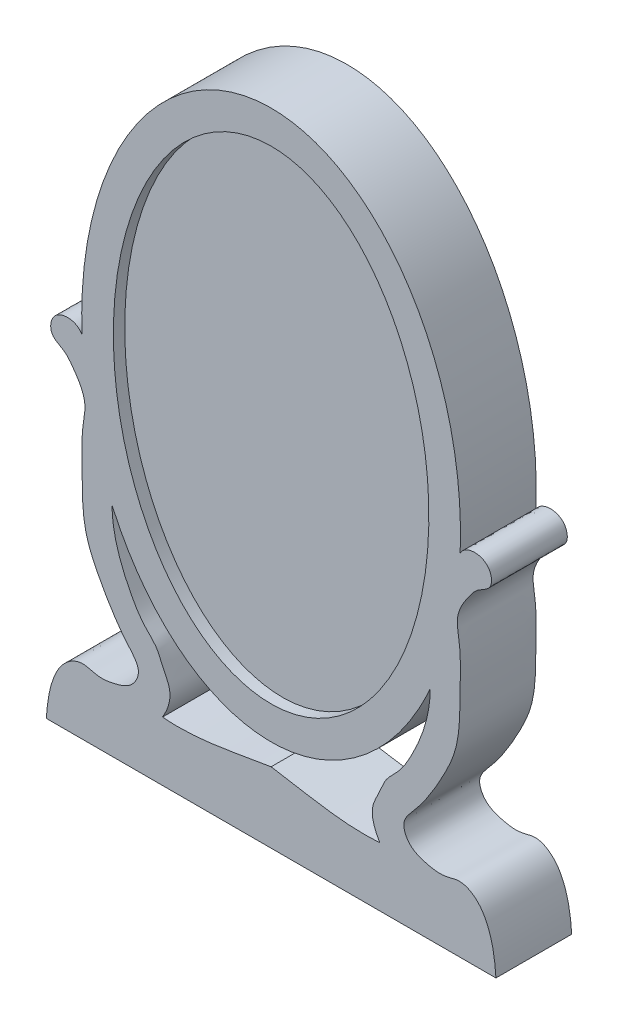
ISO-10303-21;
HEADER;
FILE_DESCRIPTION(('STEP AP214'),'2;1');
FILE_NAME('part.step','',(''),(''),'','','');
FILE_SCHEMA(('AUTOMOTIVE_DESIGN { 1 0 10303 214 1 1 1 1 }'));
ENDSEC;
DATA;
#1=APPLICATION_CONTEXT('core data for automotive mechanical design processes');
#2=APPLICATION_PROTOCOL_DEFINITION('international standard','automotive_design',2000,#1);
#3=PRODUCT_CONTEXT('',#1,'mechanical');
#4=PRODUCT('Part','Part','',(#3));
#5=PRODUCT_RELATED_PRODUCT_CATEGORY('part','',(#4));
#6=PRODUCT_DEFINITION_FORMATION('','',#4);
#7=PRODUCT_DEFINITION_CONTEXT('part definition',#1,'design');
#8=PRODUCT_DEFINITION('design','',#6,#7);
#9=PRODUCT_DEFINITION_SHAPE('','',#8);
#10=(LENGTH_UNIT() NAMED_UNIT(*) SI_UNIT(.MILLI.,.METRE.));
#11=(NAMED_UNIT(*) PLANE_ANGLE_UNIT() SI_UNIT($,.RADIAN.));
#12=(NAMED_UNIT(*) SI_UNIT($,.STERADIAN.) SOLID_ANGLE_UNIT());
#13=UNCERTAINTY_MEASURE_WITH_UNIT(LENGTH_MEASURE(1.E-05),#10,'distance_accuracy_value','');
#14=(GEOMETRIC_REPRESENTATION_CONTEXT(3) GLOBAL_UNCERTAINTY_ASSIGNED_CONTEXT((#13)) GLOBAL_UNIT_ASSIGNED_CONTEXT((#10,
#11,#12)) REPRESENTATION_CONTEXT('',''));
#15=CARTESIAN_POINT('',(0.,0.,0.));
#16=DIRECTION('',(0.,0.,1.));
#17=DIRECTION('',(1.,0.,0.));
#18=AXIS2_PLACEMENT_3D('',#15,#16,#17);
#19=CARTESIAN_POINT('',(0.,0.,5.08));
#20=DIRECTION('',(0.,0.,1.));
#21=DIRECTION('',(0.,1.,0.));
#22=AXIS2_PLACEMENT_3D('',#19,#20,#21);
#23=ELLIPSE('',#22,18.4067671188592,12.7);
#24=DIRECTION('',(0.,0.,-1.));
#25=VECTOR('',#24,1.);
#26=SURFACE_OF_LINEAR_EXTRUSION('',#23,#25);
#27=CARTESIAN_POINT('',(0.,0.,0.));
#28=DIRECTION('',(0.,0.,1.));
#29=DIRECTION('',(0.,1.,0.));
#30=AXIS2_PLACEMENT_3D('',#27,#28,#29);
#31=ELLIPSE('',#30,18.4067671188592,12.7);
#32=CARTESIAN_POINT('',(-10.6691475500699,-9.98468613821812,0.));
#33=VERTEX_POINT('',#32);
#34=CARTESIAN_POINT('',(10.6691475500699,-9.98468613821813,0.));
#35=VERTEX_POINT('',#34);
#36=EDGE_CURVE('E296',#33,#35,#31,.T.);
#37=ORIENTED_EDGE('',*,*,#36,.T.);
#38=DIRECTION('',(0.,0.,-1.));
#39=VECTOR('',#38,1.);
#40=CARTESIAN_POINT('',(10.6691475500699,-9.98468613821812,5.08));
#41=LINE('',#40,#39);
#42=CARTESIAN_POINT('',(10.6691475500699,-9.98468613821813,5.08));
#43=VERTEX_POINT('',#42);
#44=EDGE_CURVE('E193',#43,#35,#41,.T.);
#45=ORIENTED_EDGE('',*,*,#44,.F.);
#46=CARTESIAN_POINT('',(-10.6691475500699,-9.98468613821812,5.08));
#47=VERTEX_POINT('',#46);
#48=EDGE_CURVE('E12',#47,#43,#23,.T.);
#49=ORIENTED_EDGE('',*,*,#48,.F.);
#50=DIRECTION('',(0.,0.,-1.));
#51=VECTOR('',#50,1.);
#52=CARTESIAN_POINT('',(-10.6691475500699,-9.98468613821812,5.08));
#53=LINE('',#52,#51);
#54=EDGE_CURVE('E356',#47,#33,#53,.T.);
#55=ORIENTED_EDGE('',*,*,#54,.T.);
#56=EDGE_LOOP('',(#37,#45,#49,#55));
#57=FACE_BOUND('',#56,.T.);
#58=ADVANCED_FACE('F171',(#57),#26,.F.);
#59=DIRECTION('',(0.,0.,-1.));
#60=VECTOR('',#59,1.);
#61=CARTESIAN_POINT('',(-12.6771092664217,-1.10465007632971,5.08));
#62=LINE('',#61,#60);
#63=CARTESIAN_POINT('',(-12.6771092664217,-1.10465007632971,5.08));
#64=VERTEX_POINT('',#63);
#65=CARTESIAN_POINT('',(-12.6771092664217,-1.10465007632971,0.));
#66=VERTEX_POINT('',#65);
#67=EDGE_CURVE('E352',#64,#66,#62,.T.);
#68=ORIENTED_EDGE('',*,*,#67,.F.);
#69=CARTESIAN_POINT('',(12.6771092664217,-1.10465007632972,5.08));
#70=VERTEX_POINT('',#69);
#71=EDGE_CURVE('E179',#70,#64,#23,.T.);
#72=ORIENTED_EDGE('',*,*,#71,.F.);
#73=DIRECTION('',(0.,0.,-1.));
#74=VECTOR('',#73,1.);
#75=CARTESIAN_POINT('',(12.6771092664217,-1.10465007632972,5.08));
#76=LINE('',#75,#74);
#77=CARTESIAN_POINT('',(12.6771092664217,-1.10465007632972,0.));
#78=VERTEX_POINT('',#77);
#79=EDGE_CURVE('E366',#70,#78,#76,.T.);
#80=ORIENTED_EDGE('',*,*,#79,.T.);
#81=EDGE_CURVE('E175',#78,#66,#31,.T.);
#82=ORIENTED_EDGE('',*,*,#81,.T.);
#83=EDGE_LOOP('',(#68,#72,#80,#82));
#84=FACE_BOUND('',#83,.T.);
#85=ADVANCED_FACE('F340',(#84),#26,.F.);
#86=CARTESIAN_POINT('',(0.,0.,5.08));
#87=DIRECTION('',(0.,0.,1.));
#88=DIRECTION('',(1.,0.,0.));
#89=AXIS2_PLACEMENT_3D('',#86,#87,#88);
#90=PLANE('',#89);
#91=CARTESIAN_POINT('',(0.,0.,5.08));
#92=DIRECTION('',(0.,0.,1.));
#93=DIRECTION('',(0.,1.,0.));
#94=AXIS2_PLACEMENT_3D('',#91,#92,#93);
#95=ELLIPSE('',#94,16.1955645753599,10.5779148702535);
#96=CARTESIAN_POINT('',(0.,16.1955645753599,5.08));
#97=VERTEX_POINT('',#96);
#98=EDGE_CURVE('E252',#97,#97,#95,.T.);
#99=ORIENTED_EDGE('',*,*,#98,.F.);
#100=EDGE_LOOP('',(#99));
#101=FACE_BOUND('',#100,.T.);
#102=CARTESIAN_POINT('',(-7.2823839529546,-20.6026566676611,5.08));
#103=CARTESIAN_POINT('',(-6.98342277815002,-20.1098257484877,5.08));
#104=CARTESIAN_POINT('',(-6.51747466004504,-18.9769482890545,5.08));
#105=CARTESIAN_POINT('',(-7.2607339084114,-17.7808276993082,5.08));
#106=CARTESIAN_POINT('',(-7.64007112429308,-16.6788221014999,5.08));
#107=CARTESIAN_POINT('',(-8.66251628533116,-15.8172191870184,5.08));
#108=CARTESIAN_POINT('',(-9.95338431160144,-13.6011584855846,5.08));
#109=CARTESIAN_POINT('',(-10.6595747076104,-11.575789329115,5.08));
#110=CARTESIAN_POINT('',(-10.6691475500699,-9.98468613821812,5.08));
#111=B_SPLINE_CURVE_WITH_KNOTS('',3,(#102,#103,#104,#105,#106,#107,#108,#109,#110),
.UNSPECIFIED.,.F.,.F.,(4,1,1,1,1,1,4),(0.,0.15686942296698,0.269880163246726,0.345336762558088,
0.453457094986606,0.602334663585348,1.),.UNSPECIFIED.);
#112=CARTESIAN_POINT('',(-7.2823839529546,-20.6026566676611,5.08));
#113=VERTEX_POINT('',#112);
#114=EDGE_CURVE('E412',#113,#47,#111,.T.);
#115=ORIENTED_EDGE('',*,*,#114,.T.);
#116=ORIENTED_EDGE('',*,*,#48,.T.);
#117=CARTESIAN_POINT('',(7.2823839529546,-20.6026566676611,5.08));
#118=CARTESIAN_POINT('',(6.98342277815002,-20.1098257484877,5.08));
#119=CARTESIAN_POINT('',(6.51747466004504,-18.9769482890545,5.08));
#120=CARTESIAN_POINT('',(7.2607339084114,-17.7808276993082,5.08));
#121=CARTESIAN_POINT('',(7.64007112429308,-16.6788221014999,5.08));
#122=CARTESIAN_POINT('',(8.66251628533116,-15.8172191870184,5.08));
#123=CARTESIAN_POINT('',(9.95338431160143,-13.6011584855846,5.08));
#124=CARTESIAN_POINT('',(10.6595747076104,-11.575789329115,5.08));
#125=CARTESIAN_POINT('',(10.6691475500699,-9.98468613821812,5.08));
#126=B_SPLINE_CURVE_WITH_KNOTS('',3,(#117,#118,#119,#120,#121,#122,#123,#124,#125),
.UNSPECIFIED.,.F.,.F.,(4,1,1,1,1,1,4),(0.,0.15686942296698,0.269880163246726,0.345336762558088,
0.453457094986606,0.602334663585348,1.),.UNSPECIFIED.);
#127=CARTESIAN_POINT('',(7.2823839529546,-20.6026566676611,5.08));
#128=VERTEX_POINT('',#127);
#129=EDGE_CURVE('E281',#128,#43,#126,.T.);
#130=ORIENTED_EDGE('',*,*,#129,.F.);
#131=CARTESIAN_POINT('',(0.,-19.8465102284853,5.08));
#132=CARTESIAN_POINT('',(2.41324087105492,-20.2161041744648,5.08));
#133=CARTESIAN_POINT('',(4.82248646221909,-20.8171955088117,5.08));
#134=CARTESIAN_POINT('',(7.2823839529546,-20.6026566676611,5.08));
#135=B_SPLINE_CURVE_WITH_KNOTS('',3,(#131,#132,#133,#134),.UNSPECIFIED.,.F.,.F.,(4,4),(0.,1.),.UNSPECIFIED.);
#136=CARTESIAN_POINT('',(0.,-19.8465102284853,5.08));
#137=VERTEX_POINT('',#136);
#138=EDGE_CURVE('E287',#137,#128,#135,.T.);
#139=ORIENTED_EDGE('',*,*,#138,.F.);
#140=CARTESIAN_POINT('',(0.,-19.8465102284853,5.08));
#141=CARTESIAN_POINT('',(-2.41324087105492,-20.2161041744648,5.08));
#142=CARTESIAN_POINT('',(-4.82248646221909,-20.8171955088117,5.08));
#143=CARTESIAN_POINT('',(-7.2823839529546,-20.6026566676611,5.08));
#144=B_SPLINE_CURVE_WITH_KNOTS('',3,(#140,#141,#142,#143),.UNSPECIFIED.,.F.,.F.,(4,4),(0.,1.),.UNSPECIFIED.);
#145=EDGE_CURVE('E416',#137,#113,#144,.T.);
#146=ORIENTED_EDGE('',*,*,#145,.T.);
#147=EDGE_LOOP('',(#115,#116,#130,#139,#146));
#148=FACE_BOUND('',#147,.T.);
#149=ORIENTED_EDGE('',*,*,#71,.T.);
#150=CARTESIAN_POINT('',(-12.6771092664217,-1.10465007632971,5.08));
#151=CARTESIAN_POINT('',(-13.0147295738112,-0.444657082307387,5.08));
#152=CARTESIAN_POINT('',(-14.6864182706003,-0.376477606834039,5.08));
#153=CARTESIAN_POINT('',(-14.9010811595817,-2.20349874357206,5.08));
#154=CARTESIAN_POINT('',(-13.8468727845681,-2.55359481217944,5.08));
#155=CARTESIAN_POINT('',(-13.1066873430173,-3.52847703439868,5.08));
#156=CARTESIAN_POINT('',(-12.3217738470595,-4.72228430635433,5.08));
#157=CARTESIAN_POINT('',(-12.5932678124089,-6.06126416897607,5.08));
#158=CARTESIAN_POINT('',(-12.7229799806182,-7.35483466237691,5.08));
#159=CARTESIAN_POINT('',(-12.6355177118635,-9.53580701082996,5.08));
#160=CARTESIAN_POINT('',(-12.7153102267162,-12.1338117629486,5.08));
#161=CARTESIAN_POINT('',(-11.5520621134218,-14.6415573080596,5.08));
#162=CARTESIAN_POINT('',(-10.5923715383723,-16.2888823037932,5.08));
#163=CARTESIAN_POINT('',(-9.60798334182763,-17.599787288778,5.08));
#164=CARTESIAN_POINT('',(-8.6693151901891,-18.5874043002762,5.08));
#165=CARTESIAN_POINT('',(-9.25483692826294,-19.8823878131323,5.08));
#166=CARTESIAN_POINT('',(-10.4033034022069,-20.2836478061833,5.08));
#167=CARTESIAN_POINT('',(-11.5866512887487,-20.4812360129199,5.08));
#168=CARTESIAN_POINT('',(-12.6744540908924,-20.0174941263352,5.08));
#169=CARTESIAN_POINT('',(-13.9505105539649,-20.6483934910517,5.08));
#170=CARTESIAN_POINT('',(-14.8367453791331,-22.2902059831316,5.08));
#171=CARTESIAN_POINT('',(-15.0181806843243,-23.7172792454405,5.08));
#172=CARTESIAN_POINT('',(-15.073740621126,-24.5751461011091,5.08));
#173=B_SPLINE_CURVE_WITH_KNOTS('',3,(#150,#151,#152,#153,#154,#155,#156,#157,#158,#159,#160,
#161,#162,#163,#164,#165,#166,#167,#168,#169,#170,#171,#172),.UNSPECIFIED.,.F.,.F.,(4,1,1,1,1,1,
1,1,1,1,1,1,1,1,1,1,1,1,1,1,4),(0.,0.066937011974706,0.10072406911038,0.132254972668819,
0.158396111068938,0.217811022595416,0.257919350227047,0.28338305854913,0.3418917459887,
0.465467037409962,0.523432420539901,0.60221369183409,0.644587560888476,0.6838925730785,
0.717443218968928,0.758396821979991,0.795190358303998,0.829586575965607,0.863768329870619,
0.918491893212974,1.),.UNSPECIFIED.);
#174=CARTESIAN_POINT('',(-15.073740621126,-24.5751461011091,5.08));
#175=VERTEX_POINT('',#174);
#176=EDGE_CURVE('E417',#64,#175,#173,.T.);
#177=ORIENTED_EDGE('',*,*,#176,.T.);
#178=DIRECTION('',(1.,0.,0.));
#179=VECTOR('',#178,1.);
#180=CARTESIAN_POINT('',(0.,-24.5751461011091,5.08));
#181=LINE('',#180,#179);
#182=CARTESIAN_POINT('',(15.073740621126,-24.5751461011091,5.08));
#183=VERTEX_POINT('',#182);
#184=EDGE_CURVE('E326',#175,#183,#181,.T.);
#185=ORIENTED_EDGE('',*,*,#184,.T.);
#186=CARTESIAN_POINT('',(12.6771092664217,-1.10465007632971,5.08));
#187=CARTESIAN_POINT('',(13.0147295738112,-0.444657082307386,5.08));
#188=CARTESIAN_POINT('',(14.6864182706003,-0.37647760683404,5.08));
#189=CARTESIAN_POINT('',(14.9010811595817,-2.20349874357206,5.08));
#190=CARTESIAN_POINT('',(13.8468727845681,-2.55359481217944,5.08));
#191=CARTESIAN_POINT('',(13.1066873430173,-3.52847703439868,5.08));
#192=CARTESIAN_POINT('',(12.3217738470595,-4.72228430635433,5.08));
#193=CARTESIAN_POINT('',(12.5932678124089,-6.06126416897606,5.08));
#194=CARTESIAN_POINT('',(12.7229799806182,-7.35483466237691,5.08));
#195=CARTESIAN_POINT('',(12.6355177118635,-9.53580701082995,5.08));
#196=CARTESIAN_POINT('',(12.7153102267162,-12.1338117629486,5.08));
#197=CARTESIAN_POINT('',(11.5520621134218,-14.6415573080596,5.08));
#198=CARTESIAN_POINT('',(10.5923715383723,-16.2888823037932,5.08));
#199=CARTESIAN_POINT('',(9.60798334182763,-17.599787288778,5.08));
#200=CARTESIAN_POINT('',(8.6693151901891,-18.5874043002762,5.08));
#201=CARTESIAN_POINT('',(9.25483692826294,-19.8823878131323,5.08));
#202=CARTESIAN_POINT('',(10.4033034022069,-20.2836478061833,5.08));
#203=CARTESIAN_POINT('',(11.5866512887487,-20.4812360129199,5.08));
#204=CARTESIAN_POINT('',(12.6744540908924,-20.0174941263352,5.08));
#205=CARTESIAN_POINT('',(13.9505105539649,-20.6483934910517,5.08));
#206=CARTESIAN_POINT('',(14.8367453791331,-22.2902059831316,5.08));
#207=CARTESIAN_POINT('',(15.0181806843243,-23.7172792454405,5.08));
#208=CARTESIAN_POINT('',(15.073740621126,-24.5751461011091,5.08));
#209=B_SPLINE_CURVE_WITH_KNOTS('',3,(#186,#187,#188,#189,#190,#191,#192,#193,#194,#195,#196,
#197,#198,#199,#200,#201,#202,#203,#204,#205,#206,#207,#208),.UNSPECIFIED.,.F.,.F.,(4,1,1,1,1,1,
1,1,1,1,1,1,1,1,1,1,1,1,1,1,4),(0.,0.066937011974706,0.10072406911038,0.132254972668819,
0.158396111068938,0.217811022595416,0.257919350227047,0.28338305854913,0.3418917459887,
0.465467037409962,0.523432420539901,0.60221369183409,0.644587560888476,0.6838925730785,
0.717443218968928,0.758396821979991,0.795190358303998,0.829586575965607,0.863768329870619,
0.918491893212974,1.),.UNSPECIFIED.);
#210=EDGE_CURVE('E317',#70,#183,#209,.T.);
#211=ORIENTED_EDGE('',*,*,#210,.F.);
#212=EDGE_LOOP('',(#149,#177,#185,#211));
#213=FACE_BOUND('',#212,.T.);
#214=ADVANCED_FACE('F338',(#101,#148,#213),#90,.T.);
#215=CARTESIAN_POINT('',(0.,0.,0.));
#216=DIRECTION('',(0.,0.,1.));
#217=DIRECTION('',(1.,0.,0.));
#218=AXIS2_PLACEMENT_3D('',#215,#216,#217);
#219=PLANE('',#218);
#220=ORIENTED_EDGE('',*,*,#36,.F.);
#221=CARTESIAN_POINT('',(-7.2823839529546,-20.6026566676611,0.));
#222=CARTESIAN_POINT('',(-6.98342277815002,-20.1098257484877,0.));
#223=CARTESIAN_POINT('',(-6.51747466004504,-18.9769482890545,0.));
#224=CARTESIAN_POINT('',(-7.2607339084114,-17.7808276993082,0.));
#225=CARTESIAN_POINT('',(-7.64007112429308,-16.6788221014999,0.));
#226=CARTESIAN_POINT('',(-8.66251628533116,-15.8172191870184,0.));
#227=CARTESIAN_POINT('',(-9.95338431160144,-13.6011584855846,0.));
#228=CARTESIAN_POINT('',(-10.6595747076104,-11.575789329115,0.));
#229=CARTESIAN_POINT('',(-10.6691475500699,-9.98468613821812,0.));
#230=B_SPLINE_CURVE_WITH_KNOTS('',3,(#221,#222,#223,#224,#225,#226,#227,#228,#229),
.UNSPECIFIED.,.F.,.F.,(4,1,1,1,1,1,4),(0.,0.15686942296698,0.269880163246726,0.345336762558088,
0.453457094986606,0.602334663585348,1.),.UNSPECIFIED.);
#231=CARTESIAN_POINT('',(-7.2823839529546,-20.6026566676611,0.));
#232=VERTEX_POINT('',#231);
#233=EDGE_CURVE('E383',#232,#33,#230,.T.);
#234=ORIENTED_EDGE('',*,*,#233,.F.);
#235=CARTESIAN_POINT('',(0.,-19.8465102284853,0.));
#236=CARTESIAN_POINT('',(-2.41324087105492,-20.2161041744648,0.));
#237=CARTESIAN_POINT('',(-4.82248646221909,-20.8171955088117,0.));
#238=CARTESIAN_POINT('',(-7.2823839529546,-20.6026566676611,0.));
#239=B_SPLINE_CURVE_WITH_KNOTS('',3,(#235,#236,#237,#238),.UNSPECIFIED.,.F.,.F.,(4,4),(0.,1.),.UNSPECIFIED.);
#240=CARTESIAN_POINT('',(0.,-19.8465102284853,0.));
#241=VERTEX_POINT('',#240);
#242=EDGE_CURVE('E309',#241,#232,#239,.T.);
#243=ORIENTED_EDGE('',*,*,#242,.F.);
#244=CARTESIAN_POINT('',(0.,-19.8465102284853,0.));
#245=CARTESIAN_POINT('',(2.41324087105492,-20.2161041744648,0.));
#246=CARTESIAN_POINT('',(4.82248646221909,-20.8171955088117,0.));
#247=CARTESIAN_POINT('',(7.2823839529546,-20.6026566676611,0.));
#248=B_SPLINE_CURVE_WITH_KNOTS('',3,(#244,#245,#246,#247),.UNSPECIFIED.,.F.,.F.,(4,4),(0.,1.),.UNSPECIFIED.);
#249=CARTESIAN_POINT('',(7.2823839529546,-20.6026566676611,0.));
#250=VERTEX_POINT('',#249);
#251=EDGE_CURVE('E304',#241,#250,#248,.T.);
#252=ORIENTED_EDGE('',*,*,#251,.T.);
#253=CARTESIAN_POINT('',(7.2823839529546,-20.6026566676611,0.));
#254=CARTESIAN_POINT('',(6.98342277815002,-20.1098257484877,0.));
#255=CARTESIAN_POINT('',(6.51747466004504,-18.9769482890545,0.));
#256=CARTESIAN_POINT('',(7.2607339084114,-17.7808276993082,0.));
#257=CARTESIAN_POINT('',(7.64007112429308,-16.6788221014999,0.));
#258=CARTESIAN_POINT('',(8.66251628533116,-15.8172191870184,0.));
#259=CARTESIAN_POINT('',(9.95338431160143,-13.6011584855846,0.));
#260=CARTESIAN_POINT('',(10.6595747076104,-11.575789329115,0.));
#261=CARTESIAN_POINT('',(10.6691475500699,-9.98468613821812,0.));
#262=B_SPLINE_CURVE_WITH_KNOTS('',3,(#253,#254,#255,#256,#257,#258,#259,#260,#261),
.UNSPECIFIED.,.F.,.F.,(4,1,1,1,1,1,4),(0.,0.15686942296698,0.269880163246726,0.345336762558088,
0.453457094986606,0.602334663585348,1.),.UNSPECIFIED.);
#263=EDGE_CURVE('E301',#250,#35,#262,.T.);
#264=ORIENTED_EDGE('',*,*,#263,.T.);
#265=EDGE_LOOP('',(#220,#234,#243,#252,#264));
#266=FACE_BOUND('',#265,.T.);
#267=CARTESIAN_POINT('',(-12.6771092664217,-1.10465007632971,0.));
#268=CARTESIAN_POINT('',(-13.0147295738112,-0.444657082307387,0.));
#269=CARTESIAN_POINT('',(-14.6864182706003,-0.376477606834039,0.));
#270=CARTESIAN_POINT('',(-14.9010811595817,-2.20349874357206,0.));
#271=CARTESIAN_POINT('',(-13.8468727845681,-2.55359481217944,0.));
#272=CARTESIAN_POINT('',(-13.1066873430173,-3.52847703439868,0.));
#273=CARTESIAN_POINT('',(-12.3217738470595,-4.72228430635433,0.));
#274=CARTESIAN_POINT('',(-12.5932678124089,-6.06126416897607,0.));
#275=CARTESIAN_POINT('',(-12.7229799806182,-7.35483466237691,0.));
#276=CARTESIAN_POINT('',(-12.6355177118635,-9.53580701082996,0.));
#277=CARTESIAN_POINT('',(-12.7153102267162,-12.1338117629486,0.));
#278=CARTESIAN_POINT('',(-11.5520621134218,-14.6415573080596,0.));
#279=CARTESIAN_POINT('',(-10.5923715383723,-16.2888823037932,0.));
#280=CARTESIAN_POINT('',(-9.60798334182763,-17.599787288778,0.));
#281=CARTESIAN_POINT('',(-8.6693151901891,-18.5874043002762,0.));
#282=CARTESIAN_POINT('',(-9.25483692826294,-19.8823878131323,0.));
#283=CARTESIAN_POINT('',(-10.4033034022069,-20.2836478061833,0.));
#284=CARTESIAN_POINT('',(-11.5866512887487,-20.4812360129199,0.));
#285=CARTESIAN_POINT('',(-12.6744540908924,-20.0174941263352,0.));
#286=CARTESIAN_POINT('',(-13.9505105539649,-20.6483934910517,0.));
#287=CARTESIAN_POINT('',(-14.8367453791331,-22.2902059831316,0.));
#288=CARTESIAN_POINT('',(-15.0181806843243,-23.7172792454405,0.));
#289=CARTESIAN_POINT('',(-15.073740621126,-24.5751461011091,0.));
#290=B_SPLINE_CURVE_WITH_KNOTS('',3,(#267,#268,#269,#270,#271,#272,#273,#274,#275,#276,#277,
#278,#279,#280,#281,#282,#283,#284,#285,#286,#287,#288,#289),.UNSPECIFIED.,.F.,.F.,(4,1,1,1,1,1,
1,1,1,1,1,1,1,1,1,1,1,1,1,1,4),(0.,0.066937011974706,0.10072406911038,0.132254972668819,
0.158396111068938,0.217811022595416,0.257919350227047,0.28338305854913,0.3418917459887,
0.465467037409962,0.523432420539901,0.60221369183409,0.644587560888476,0.6838925730785,
0.717443218968928,0.758396821979991,0.795190358303998,0.829586575965607,0.863768329870619,
0.918491893212974,1.),.UNSPECIFIED.);
#291=CARTESIAN_POINT('',(-15.073740621126,-24.5751461011091,0.));
#292=VERTEX_POINT('',#291);
#293=EDGE_CURVE('E379',#66,#292,#290,.T.);
#294=ORIENTED_EDGE('',*,*,#293,.F.);
#295=ORIENTED_EDGE('',*,*,#81,.F.);
#296=CARTESIAN_POINT('',(12.6771092664217,-1.10465007632971,0.));
#297=CARTESIAN_POINT('',(13.0147295738112,-0.444657082307386,0.));
#298=CARTESIAN_POINT('',(14.6864182706003,-0.37647760683404,0.));
#299=CARTESIAN_POINT('',(14.9010811595817,-2.20349874357206,0.));
#300=CARTESIAN_POINT('',(13.8468727845681,-2.55359481217944,0.));
#301=CARTESIAN_POINT('',(13.1066873430173,-3.52847703439868,0.));
#302=CARTESIAN_POINT('',(12.3217738470595,-4.72228430635433,0.));
#303=CARTESIAN_POINT('',(12.5932678124089,-6.06126416897606,0.));
#304=CARTESIAN_POINT('',(12.7229799806182,-7.35483466237691,0.));
#305=CARTESIAN_POINT('',(12.6355177118635,-9.53580701082995,0.));
#306=CARTESIAN_POINT('',(12.7153102267162,-12.1338117629486,0.));
#307=CARTESIAN_POINT('',(11.5520621134218,-14.6415573080596,0.));
#308=CARTESIAN_POINT('',(10.5923715383723,-16.2888823037932,0.));
#309=CARTESIAN_POINT('',(9.60798334182763,-17.599787288778,0.));
#310=CARTESIAN_POINT('',(8.6693151901891,-18.5874043002762,0.));
#311=CARTESIAN_POINT('',(9.25483692826294,-19.8823878131323,0.));
#312=CARTESIAN_POINT('',(10.4033034022069,-20.2836478061833,0.));
#313=CARTESIAN_POINT('',(11.5866512887487,-20.4812360129199,0.));
#314=CARTESIAN_POINT('',(12.6744540908924,-20.0174941263352,0.));
#315=CARTESIAN_POINT('',(13.9505105539649,-20.6483934910517,0.));
#316=CARTESIAN_POINT('',(14.8367453791331,-22.2902059831316,0.));
#317=CARTESIAN_POINT('',(15.0181806843243,-23.7172792454405,0.));
#318=CARTESIAN_POINT('',(15.073740621126,-24.5751461011091,0.));
#319=B_SPLINE_CURVE_WITH_KNOTS('',3,(#296,#297,#298,#299,#300,#301,#302,#303,#304,#305,#306,
#307,#308,#309,#310,#311,#312,#313,#314,#315,#316,#317,#318),.UNSPECIFIED.,.F.,.F.,(4,1,1,1,1,1,
1,1,1,1,1,1,1,1,1,1,1,1,1,1,4),(0.,0.066937011974706,0.10072406911038,0.132254972668819,
0.158396111068938,0.217811022595416,0.257919350227047,0.28338305854913,0.3418917459887,
0.465467037409962,0.523432420539901,0.60221369183409,0.644587560888476,0.6838925730785,
0.717443218968928,0.758396821979991,0.795190358303998,0.829586575965607,0.863768329870619,
0.918491893212974,1.),.UNSPECIFIED.);
#320=CARTESIAN_POINT('',(15.073740621126,-24.5751461011091,0.));
#321=VERTEX_POINT('',#320);
#322=EDGE_CURVE('E286',#78,#321,#319,.T.);
#323=ORIENTED_EDGE('',*,*,#322,.T.);
#324=DIRECTION('',(1.,0.,0.));
#325=VECTOR('',#324,1.);
#326=CARTESIAN_POINT('',(0.,-24.5751461011091,0.));
#327=LINE('',#326,#325);
#328=EDGE_CURVE('E373',#292,#321,#327,.T.);
#329=ORIENTED_EDGE('',*,*,#328,.F.);
#330=EDGE_LOOP('',(#294,#295,#323,#329));
#331=FACE_BOUND('',#330,.T.);
#332=ADVANCED_FACE('F277',(#266,#331),#219,.F.);
#333=DIRECTION('',(0.,0.,-1.));
#334=VECTOR('',#333,1.);
#335=SURFACE_OF_LINEAR_EXTRUSION('',#126,#334);
#336=ORIENTED_EDGE('',*,*,#263,.F.);
#337=DIRECTION('',(0.,0.,-1.));
#338=VECTOR('',#337,1.);
#339=CARTESIAN_POINT('',(7.2823839529546,-20.6026566676611,5.08));
#340=LINE('',#339,#338);
#341=EDGE_CURVE('E263',#128,#250,#340,.T.);
#342=ORIENTED_EDGE('',*,*,#341,.F.);
#343=ORIENTED_EDGE('',*,*,#129,.T.);
#344=ORIENTED_EDGE('',*,*,#44,.T.);
#345=EDGE_LOOP('',(#336,#342,#343,#344));
#346=FACE_BOUND('',#345,.T.);
#347=ADVANCED_FACE('F272',(#346),#335,.T.);
#348=DIRECTION('',(0.,0.,-1.));
#349=VECTOR('',#348,1.);
#350=SURFACE_OF_LINEAR_EXTRUSION('',#135,#349);
#351=ORIENTED_EDGE('',*,*,#251,.F.);
#352=DIRECTION('',(0.,0.,-1.));
#353=VECTOR('',#352,1.);
#354=CARTESIAN_POINT('',(0.,-19.8465102284853,5.08));
#355=LINE('',#354,#353);
#356=EDGE_CURVE('E405',#137,#241,#355,.T.);
#357=ORIENTED_EDGE('',*,*,#356,.F.);
#358=ORIENTED_EDGE('',*,*,#138,.T.);
#359=ORIENTED_EDGE('',*,*,#341,.T.);
#360=EDGE_LOOP('',(#351,#357,#358,#359));
#361=FACE_BOUND('',#360,.T.);
#362=ADVANCED_FACE('F276',(#361),#350,.T.);
#363=DIRECTION('',(0.,0.,-1.));
#364=VECTOR('',#363,1.);
#365=SURFACE_OF_LINEAR_EXTRUSION('',#144,#364);
#366=ORIENTED_EDGE('',*,*,#242,.T.);
#367=DIRECTION('',(0.,0.,-1.));
#368=VECTOR('',#367,1.);
#369=CARTESIAN_POINT('',(-7.2823839529546,-20.6026566676611,5.08));
#370=LINE('',#369,#368);
#371=EDGE_CURVE('E361',#113,#232,#370,.T.);
#372=ORIENTED_EDGE('',*,*,#371,.F.);
#373=ORIENTED_EDGE('',*,*,#145,.F.);
#374=ORIENTED_EDGE('',*,*,#356,.T.);
#375=EDGE_LOOP('',(#366,#372,#373,#374));
#376=FACE_BOUND('',#375,.T.);
#377=ADVANCED_FACE('F402',(#376),#365,.F.);
#378=DIRECTION('',(0.,0.,-1.));
#379=VECTOR('',#378,1.);
#380=SURFACE_OF_LINEAR_EXTRUSION('',#111,#379);
#381=ORIENTED_EDGE('',*,*,#233,.T.);
#382=ORIENTED_EDGE('',*,*,#54,.F.);
#383=ORIENTED_EDGE('',*,*,#114,.F.);
#384=ORIENTED_EDGE('',*,*,#371,.T.);
#385=EDGE_LOOP('',(#381,#382,#383,#384));
#386=FACE_BOUND('',#385,.T.);
#387=ADVANCED_FACE('F409',(#386),#380,.F.);
#388=DIRECTION('',(0.,0.,-1.));
#389=VECTOR('',#388,1.);
#390=SURFACE_OF_LINEAR_EXTRUSION('',#173,#389);
#391=ORIENTED_EDGE('',*,*,#293,.T.);
#392=DIRECTION('',(0.,0.,-1.));
#393=VECTOR('',#392,1.);
#394=CARTESIAN_POINT('',(-15.073740621126,-24.5751461011091,5.08));
#395=LINE('',#394,#393);
#396=EDGE_CURVE('E355',#175,#292,#395,.T.);
#397=ORIENTED_EDGE('',*,*,#396,.F.);
#398=ORIENTED_EDGE('',*,*,#176,.F.);
#399=ORIENTED_EDGE('',*,*,#67,.T.);
#400=EDGE_LOOP('',(#391,#397,#398,#399));
#401=FACE_BOUND('',#400,.T.);
#402=ADVANCED_FACE('F433',(#401),#390,.F.);
#403=CARTESIAN_POINT('',(0.,-24.5751461011091,5.08));
#404=DIRECTION('',(0.,1.,0.));
#405=DIRECTION('',(0.,0.,1.));
#406=AXIS2_PLACEMENT_3D('',#403,#404,#405);
#407=PLANE('',#406);
#408=CARTESIAN_POINT('',(0.,-24.5751461011091,2.54));
#409=DIRECTION('',(0.,-1.,0.));
#410=DIRECTION('',(0.,0.,-1.));
#411=AXIS2_PLACEMENT_3D('',#408,#409,#410);
#412=CIRCLE('',#411,1.72719999999999);
#413=CARTESIAN_POINT('',(0.,-24.5751461011091,0.812800000000011));
#414=VERTEX_POINT('',#413);
#415=EDGE_CURVE('E253',#414,#414,#412,.T.);
#416=ORIENTED_EDGE('',*,*,#415,.F.);
#417=EDGE_LOOP('',(#416));
#418=FACE_BOUND('',#417,.T.);
#419=ORIENTED_EDGE('',*,*,#328,.T.);
#420=DIRECTION('',(0.,0.,-1.));
#421=VECTOR('',#420,1.);
#422=CARTESIAN_POINT('',(15.073740621126,-24.5751461011091,5.08));
#423=LINE('',#422,#421);
#424=EDGE_CURVE('E359',#183,#321,#423,.T.);
#425=ORIENTED_EDGE('',*,*,#424,.F.);
#426=ORIENTED_EDGE('',*,*,#184,.F.);
#427=ORIENTED_EDGE('',*,*,#396,.T.);
#428=EDGE_LOOP('',(#419,#425,#426,#427));
#429=FACE_BOUND('',#428,.T.);
#430=ADVANCED_FACE('F335',(#418,#429),#407,.F.);
#431=DIRECTION('',(0.,0.,-1.));
#432=VECTOR('',#431,1.);
#433=SURFACE_OF_LINEAR_EXTRUSION('',#209,#432);
#434=ORIENTED_EDGE('',*,*,#322,.F.);
#435=ORIENTED_EDGE('',*,*,#79,.F.);
#436=ORIENTED_EDGE('',*,*,#210,.T.);
#437=ORIENTED_EDGE('',*,*,#424,.T.);
#438=EDGE_LOOP('',(#434,#435,#436,#437));
#439=FACE_BOUND('',#438,.T.);
#440=ADVANCED_FACE('F270',(#439),#433,.T.);
#441=CARTESIAN_POINT('',(0.,0.,4.318));
#442=DIRECTION('',(0.,0.,1.));
#443=DIRECTION('',(0.,1.,0.));
#444=AXIS2_PLACEMENT_3D('',#441,#442,#443);
#445=ELLIPSE('',#444,16.1955645753599,10.5779148702535);
#446=DIRECTION('',(0.,0.,1.));
#447=VECTOR('',#446,1.);
#448=SURFACE_OF_LINEAR_EXTRUSION('',#445,#447);
#449=CARTESIAN_POINT('',(0.,16.1955645753599,4.318));
#450=VERTEX_POINT('',#449);
#451=EDGE_CURVE('E256',#450,#450,#445,.T.);
#452=ORIENTED_EDGE('',*,*,#451,.F.);
#453=EDGE_LOOP('',(#452));
#454=FACE_BOUND('',#453,.T.);
#455=ORIENTED_EDGE('',*,*,#98,.T.);
#456=EDGE_LOOP('',(#455));
#457=FACE_BOUND('',#456,.T.);
#458=ADVANCED_FACE('F266',(#454,#457),#448,.F.);
#459=CARTESIAN_POINT('',(0.,0.,4.318));
#460=DIRECTION('',(0.,0.,1.));
#461=DIRECTION('',(1.,0.,0.));
#462=AXIS2_PLACEMENT_3D('',#459,#460,#461);
#463=PLANE('',#462);
#464=ORIENTED_EDGE('',*,*,#451,.T.);
#465=EDGE_LOOP('',(#464));
#466=FACE_BOUND('',#465,.T.);
#467=ADVANCED_FACE('F246',(#466),#463,.T.);
#468=CARTESIAN_POINT('',(0.,-22.0351461011091,2.54));
#469=DIRECTION('',(0.,-1.,0.));
#470=DIRECTION('',(0.,0.,-1.));
#471=AXIS2_PLACEMENT_3D('',#468,#469,#470);
#472=CONICAL_SURFACE('',#471,1.7272,1.02974425867665);
#473=CARTESIAN_POINT('',(0.,-20.9973396399247,2.54));
#474=VERTEX_POINT('',#473);
#475=VERTEX_LOOP('',#474);
#476=FACE_BOUND('',#475,.T.);
#477=CARTESIAN_POINT('',(0.,-22.0351461011091,2.54));
#478=DIRECTION('',(0.,-1.,0.));
#479=DIRECTION('',(0.,0.,-1.));
#480=AXIS2_PLACEMENT_3D('',#477,#478,#479);
#481=CIRCLE('',#480,1.7272);
#482=CARTESIAN_POINT('',(0.,-22.0351461011091,0.812800000000001));
#483=VERTEX_POINT('',#482);
#484=EDGE_CURVE('E250',#483,#483,#481,.T.);
#485=ORIENTED_EDGE('',*,*,#484,.T.);
#486=EDGE_LOOP('',(#485));
#487=FACE_BOUND('',#486,.T.);
#488=ADVANCED_FACE('F242',(#476,#487),#472,.F.);
#489=CARTESIAN_POINT('',(0.,-24.5751461011091,2.54));
#490=DIRECTION('',(0.,-1.,0.));
#491=DIRECTION('',(0.,0.,-1.));
#492=AXIS2_PLACEMENT_3D('',#489,#490,#491);
#493=CYLINDRICAL_SURFACE('',#492,1.72719999999999);
#494=ORIENTED_EDGE('',*,*,#484,.F.);
#495=EDGE_LOOP('',(#494));
#496=FACE_BOUND('',#495,.T.);
#497=ORIENTED_EDGE('',*,*,#415,.T.);
#498=EDGE_LOOP('',(#497));
#499=FACE_BOUND('',#498,.T.);
#500=ADVANCED_FACE('F245',(#496,#499),#493,.F.);
#501=CLOSED_SHELL('',(#58,#85,#214,#332,#347,#362,#377,#387,#402,#430,#440,#458,#467,#488,#500));
#502=MANIFOLD_SOLID_BREP('B2',#501);
#503=ADVANCED_BREP_SHAPE_REPRESENTATION('',(#18,#502),#14);
#504=SHAPE_DEFINITION_REPRESENTATION(#9,#503);
ENDSEC;
END-ISO-10303-21;
